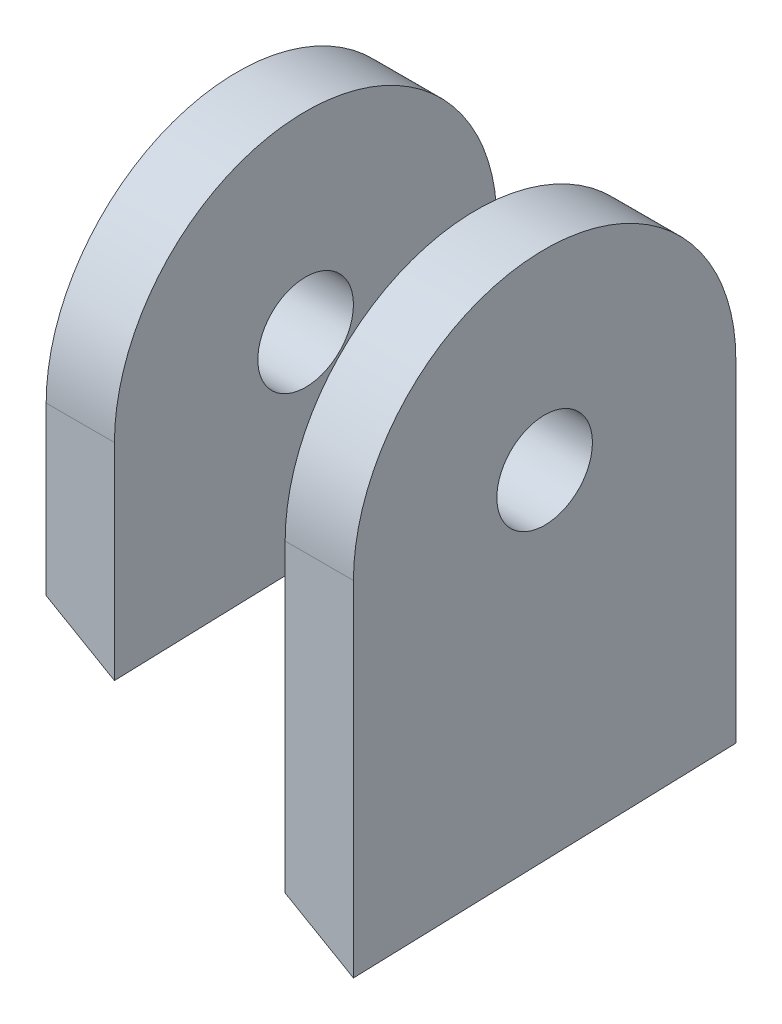
ISO-10303-21;
HEADER;
FILE_DESCRIPTION(('STEP AP214'),'2;1');
FILE_NAME('part.step','',(''),(''),'','','');
FILE_SCHEMA(('AUTOMOTIVE_DESIGN { 1 0 10303 214 1 1 1 1 }'));
ENDSEC;
DATA;
#1=APPLICATION_CONTEXT('core data for automotive mechanical design processes');
#2=APPLICATION_PROTOCOL_DEFINITION('international standard','automotive_design',2000,#1);
#3=PRODUCT_CONTEXT('',#1,'mechanical');
#4=PRODUCT('Part','Part','',(#3));
#5=PRODUCT_RELATED_PRODUCT_CATEGORY('part','',(#4));
#6=PRODUCT_DEFINITION_FORMATION('','',#4);
#7=PRODUCT_DEFINITION_CONTEXT('part definition',#1,'design');
#8=PRODUCT_DEFINITION('design','',#6,#7);
#9=PRODUCT_DEFINITION_SHAPE('','',#8);
#10=(LENGTH_UNIT() NAMED_UNIT(*) SI_UNIT(.MILLI.,.METRE.));
#11=(NAMED_UNIT(*) PLANE_ANGLE_UNIT() SI_UNIT($,.RADIAN.));
#12=(NAMED_UNIT(*) SI_UNIT($,.STERADIAN.) SOLID_ANGLE_UNIT());
#13=UNCERTAINTY_MEASURE_WITH_UNIT(LENGTH_MEASURE(1.E-05),#10,'distance_accuracy_value','');
#14=(GEOMETRIC_REPRESENTATION_CONTEXT(3) GLOBAL_UNCERTAINTY_ASSIGNED_CONTEXT((#13)) GLOBAL_UNIT_ASSIGNED_CONTEXT((#10,
#11,#12)) REPRESENTATION_CONTEXT('',''));
#15=CARTESIAN_POINT('',(0.,0.,0.));
#16=DIRECTION('',(0.,0.,1.));
#17=DIRECTION('',(1.,0.,0.));
#18=AXIS2_PLACEMENT_3D('',#15,#16,#17);
#19=CARTESIAN_POINT('',(-35.,0.,0.));
#20=DIRECTION('',(1.,0.,0.));
#21=DIRECTION('',(0.,0.,-1.));
#22=AXIS2_PLACEMENT_3D('',#19,#20,#21);
#23=CYLINDRICAL_SURFACE('',#22,28.);
#24=DIRECTION('',(1.,0.,0.));
#25=VECTOR('',#24,1.);
#26=CARTESIAN_POINT('',(-35.,0.,28.));
#27=LINE('',#26,#25);
#28=CARTESIAN_POINT('',(-35.,0.,28.));
#29=VERTEX_POINT('',#28);
#30=CARTESIAN_POINT('',(-25.,0.,28.));
#31=VERTEX_POINT('',#30);
#32=EDGE_CURVE('E111',#29,#31,#27,.T.);
#33=ORIENTED_EDGE('',*,*,#32,.T.);
#34=CARTESIAN_POINT('',(-25.,0.,0.));
#35=DIRECTION('',(1.,0.,0.));
#36=DIRECTION('',(0.,0.,-1.));
#37=AXIS2_PLACEMENT_3D('',#34,#35,#36);
#38=CIRCLE('',#37,28.);
#39=CARTESIAN_POINT('',(-25.,0.,-28.));
#40=VERTEX_POINT('',#39);
#41=EDGE_CURVE('E97',#40,#31,#38,.T.);
#42=ORIENTED_EDGE('',*,*,#41,.F.);
#43=DIRECTION('',(1.,0.,0.));
#44=VECTOR('',#43,1.);
#45=CARTESIAN_POINT('',(-35.,0.,-28.));
#46=LINE('',#45,#44);
#47=CARTESIAN_POINT('',(-35.,0.,-28.));
#48=VERTEX_POINT('',#47);
#49=EDGE_CURVE('E107',#48,#40,#46,.T.);
#50=ORIENTED_EDGE('',*,*,#49,.F.);
#51=CARTESIAN_POINT('',(-35.,0.,0.));
#52=DIRECTION('',(1.,0.,0.));
#53=DIRECTION('',(0.,0.,-1.));
#54=AXIS2_PLACEMENT_3D('',#51,#52,#53);
#55=CIRCLE('',#54,28.);
#56=EDGE_CURVE('E110',#48,#29,#55,.T.);
#57=ORIENTED_EDGE('',*,*,#56,.T.);
#58=EDGE_LOOP('',(#33,#42,#50,#57));
#59=FACE_BOUND('',#58,.T.);
#60=ADVANCED_FACE('F45',(#59),#23,.T.);
#61=CARTESIAN_POINT('',(-35.,0.,-28.));
#62=DIRECTION('',(0.,0.,-1.));
#63=DIRECTION('',(0.,1.,0.));
#64=AXIS2_PLACEMENT_3D('',#61,#62,#63);
#65=PLANE('',#64);
#66=DIRECTION('',(0.865916014303439,-0.500189420292799,0.));
#67=VECTOR('',#66,1.);
#68=CARTESIAN_POINT('',(-44.8060613951846,-16.9760199933108,-28.));
#69=LINE('',#68,#67);
#70=CARTESIAN_POINT('',(-35.,-22.6404124789476,-28.));
#71=VERTEX_POINT('',#70);
#72=CARTESIAN_POINT('',(-25.,-28.416832039627,-28.));
#73=VERTEX_POINT('',#72);
#74=EDGE_CURVE('E59',#71,#73,#69,.T.);
#75=ORIENTED_EDGE('',*,*,#74,.F.);
#76=DIRECTION('',(0.,1.,0.));
#77=VECTOR('',#76,1.);
#78=CARTESIAN_POINT('',(-35.,0.,-28.));
#79=LINE('',#78,#77);
#80=EDGE_CURVE('E109',#71,#48,#79,.T.);
#81=ORIENTED_EDGE('',*,*,#80,.T.);
#82=ORIENTED_EDGE('',*,*,#49,.T.);
#83=DIRECTION('',(0.,1.,0.));
#84=VECTOR('',#83,1.);
#85=CARTESIAN_POINT('',(-25.,0.,-28.));
#86=LINE('',#85,#84);
#87=EDGE_CURVE('E53',#73,#40,#86,.T.);
#88=ORIENTED_EDGE('',*,*,#87,.F.);
#89=EDGE_LOOP('',(#75,#81,#82,#88));
#90=FACE_BOUND('',#89,.T.);
#91=ADVANCED_FACE('F140',(#90),#65,.T.);
#92=CARTESIAN_POINT('',(-35.,0.,28.));
#93=DIRECTION('',(0.,0.,1.));
#94=DIRECTION('',(0.,-1.,0.));
#95=AXIS2_PLACEMENT_3D('',#92,#93,#94);
#96=PLANE('',#95);
#97=DIRECTION('',(-0.865916014303439,0.500189420292799,0.));
#98=VECTOR('',#97,1.);
#99=CARTESIAN_POINT('',(-45.5771546501737,-18.3109182756965,28.));
#100=LINE('',#99,#98);
#101=CARTESIAN_POINT('',(-25.,-30.1971461381355,28.));
#102=VERTEX_POINT('',#101);
#103=CARTESIAN_POINT('',(-35.,-24.420726577456,28.));
#104=VERTEX_POINT('',#103);
#105=EDGE_CURVE('E83',#102,#104,#100,.T.);
#106=ORIENTED_EDGE('',*,*,#105,.F.);
#107=DIRECTION('',(0.,-1.,0.));
#108=VECTOR('',#107,1.);
#109=CARTESIAN_POINT('',(-25.,0.,28.));
#110=LINE('',#109,#108);
#111=EDGE_CURVE('E90',#31,#102,#110,.T.);
#112=ORIENTED_EDGE('',*,*,#111,.F.);
#113=ORIENTED_EDGE('',*,*,#32,.F.);
#114=DIRECTION('',(0.,-1.,0.));
#115=VECTOR('',#114,1.);
#116=CARTESIAN_POINT('',(-35.,0.,28.));
#117=LINE('',#116,#115);
#118=EDGE_CURVE('E93',#29,#104,#117,.T.);
#119=ORIENTED_EDGE('',*,*,#118,.T.);
#120=EDGE_LOOP('',(#106,#112,#113,#119));
#121=FACE_BOUND('',#120,.T.);
#122=ADVANCED_FACE('F89',(#121),#96,.T.);
#123=CARTESIAN_POINT('',(-35.,0.,0.));
#124=DIRECTION('',(1.,0.,0.));
#125=DIRECTION('',(0.,0.,-1.));
#126=AXIS2_PLACEMENT_3D('',#123,#124,#125);
#127=CYLINDRICAL_SURFACE('',#126,7.);
#128=CARTESIAN_POINT('',(-35.,0.,0.));
#129=DIRECTION('',(1.,0.,0.));
#130=DIRECTION('',(0.,0.,-1.));
#131=AXIS2_PLACEMENT_3D('',#128,#129,#130);
#132=CIRCLE('',#131,7.);
#133=CARTESIAN_POINT('',(-35.,0.,-7.));
#134=VERTEX_POINT('',#133);
#135=EDGE_CURVE('E100',#134,#134,#132,.T.);
#136=ORIENTED_EDGE('',*,*,#135,.F.);
#137=EDGE_LOOP('',(#136));
#138=FACE_BOUND('',#137,.T.);
#139=CARTESIAN_POINT('',(-25.,0.,0.));
#140=DIRECTION('',(1.,0.,0.));
#141=DIRECTION('',(0.,0.,-1.));
#142=AXIS2_PLACEMENT_3D('',#139,#140,#141);
#143=CIRCLE('',#142,7.);
#144=CARTESIAN_POINT('',(-25.,0.,-7.));
#145=VERTEX_POINT('',#144);
#146=EDGE_CURVE('E104',#145,#145,#143,.T.);
#147=ORIENTED_EDGE('',*,*,#146,.T.);
#148=EDGE_LOOP('',(#147));
#149=FACE_BOUND('',#148,.T.);
#150=ADVANCED_FACE('F47',(#138,#149),#127,.F.);
#151=CARTESIAN_POINT('',(-35.,0.,0.));
#152=DIRECTION('',(1.,0.,0.));
#153=DIRECTION('',(0.,0.,-1.));
#154=AXIS2_PLACEMENT_3D('',#151,#152,#153);
#155=PLANE('',#154);
#156=ORIENTED_EDGE('',*,*,#135,.T.);
#157=EDGE_LOOP('',(#156));
#158=FACE_BOUND('',#157,.T.);
#159=ORIENTED_EDGE('',*,*,#80,.F.);
#160=DIRECTION('',(0.,-0.0317752697972741,0.999495038621658));
#161=VECTOR('',#160,1.);
#162=CARTESIAN_POINT('',(-35.,-23.5068114705232,-0.747312640570566));
#163=LINE('',#162,#161);
#164=EDGE_CURVE('E112',#71,#104,#163,.T.);
#165=ORIENTED_EDGE('',*,*,#164,.T.);
#166=ORIENTED_EDGE('',*,*,#118,.F.);
#167=ORIENTED_EDGE('',*,*,#56,.F.);
#168=EDGE_LOOP('',(#159,#165,#166,#167));
#169=FACE_BOUND('',#168,.T.);
#170=ADVANCED_FACE('F125',(#158,#169),#155,.F.);
#171=CARTESIAN_POINT('',(-25.,0.,0.));
#172=DIRECTION('',(1.,0.,0.));
#173=DIRECTION('',(0.,0.,-1.));
#174=AXIS2_PLACEMENT_3D('',#171,#172,#173);
#175=PLANE('',#174);
#176=DIRECTION('',(0.,-0.0317752697972741,0.999495038621658));
#177=VECTOR('',#176,1.);
#178=CARTESIAN_POINT('',(-25.,-29.2773987665423,-0.930767246280857));
#179=LINE('',#178,#177);
#180=EDGE_CURVE('E12',#73,#102,#179,.T.);
#181=ORIENTED_EDGE('',*,*,#180,.F.);
#182=ORIENTED_EDGE('',*,*,#87,.T.);
#183=ORIENTED_EDGE('',*,*,#41,.T.);
#184=ORIENTED_EDGE('',*,*,#111,.T.);
#185=EDGE_LOOP('',(#181,#182,#183,#184));
#186=FACE_BOUND('',#185,.T.);
#187=ORIENTED_EDGE('',*,*,#146,.F.);
#188=EDGE_LOOP('',(#187));
#189=FACE_BOUND('',#188,.T.);
#190=ADVANCED_FACE('F95',(#186,#189),#175,.T.);
#191=CARTESIAN_POINT('',(-18.9338904190651,-32.7779002549425,-1.04205282041745));
#192=DIRECTION('',(0.499999999999998,0.865588094402866,0.0275181908565438));
#193=DIRECTION('',(-0.865916014303439,0.500189420292799,0.));
#194=AXIS2_PLACEMENT_3D('',#191,#192,#193);
#195=PLANE('',#194);
#196=ORIENTED_EDGE('',*,*,#74,.T.);
#197=ORIENTED_EDGE('',*,*,#180,.T.);
#198=ORIENTED_EDGE('',*,*,#105,.T.);
#199=ORIENTED_EDGE('',*,*,#164,.F.);
#200=EDGE_LOOP('',(#196,#197,#198,#199));
#201=FACE_BOUND('',#200,.T.);
#202=ADVANCED_FACE('F82',(#201),#195,.F.);
#203=CLOSED_SHELL('',(#60,#91,#122,#150,#170,#190,#202));
#204=MANIFOLD_SOLID_BREP('B2',#203);
#205=CARTESIAN_POINT('',(-35.,0.,28.));
#206=DIRECTION('',(0.,0.,1.));
#207=DIRECTION('',(0.,-1.,0.));
#208=AXIS2_PLACEMENT_3D('',#205,#206,#207);
#209=PLANE('',#208);
#210=DIRECTION('',(-0.865916014303439,0.500189420292799,0.));
#211=VECTOR('',#210,1.);
#212=CARTESIAN_POINT('',(-45.5771546501737,-18.3109182756965,28.));
#213=LINE('',#212,#211);
#214=CARTESIAN_POINT('',(10.,-50.4146146005136,28.));
#215=VERTEX_POINT('',#214);
#216=CARTESIAN_POINT('',(0.,-44.6381950398341,28.));
#217=VERTEX_POINT('',#216);
#218=EDGE_CURVE('E205',#215,#217,#213,.T.);
#219=ORIENTED_EDGE('',*,*,#218,.F.);
#220=DIRECTION('',(0.,-1.,0.));
#221=VECTOR('',#220,1.);
#222=CARTESIAN_POINT('',(10.,0.,28.));
#223=LINE('',#222,#221);
#224=CARTESIAN_POINT('',(10.,0.,28.));
#225=VERTEX_POINT('',#224);
#226=EDGE_CURVE('E254',#225,#215,#223,.T.);
#227=ORIENTED_EDGE('',*,*,#226,.F.);
#228=DIRECTION('',(1.,0.,0.));
#229=VECTOR('',#228,1.);
#230=CARTESIAN_POINT('',(-35.,0.,28.));
#231=LINE('',#230,#229);
#232=CARTESIAN_POINT('',(0.,0.,28.));
#233=VERTEX_POINT('',#232);
#234=EDGE_CURVE('E258',#233,#225,#231,.T.);
#235=ORIENTED_EDGE('',*,*,#234,.F.);
#236=DIRECTION('',(0.,-1.,0.));
#237=VECTOR('',#236,1.);
#238=CARTESIAN_POINT('',(0.,0.,28.));
#239=LINE('',#238,#237);
#240=EDGE_CURVE('E245',#233,#217,#239,.T.);
#241=ORIENTED_EDGE('',*,*,#240,.T.);
#242=EDGE_LOOP('',(#219,#227,#235,#241));
#243=FACE_BOUND('',#242,.T.);
#244=ADVANCED_FACE('F190',(#243),#209,.T.);
#245=CARTESIAN_POINT('',(-35.,0.,-28.));
#246=DIRECTION('',(0.,0.,-1.));
#247=DIRECTION('',(0.,1.,0.));
#248=AXIS2_PLACEMENT_3D('',#245,#246,#247);
#249=PLANE('',#248);
#250=DIRECTION('',(0.865916014303439,-0.500189420292799,0.));
#251=VECTOR('',#250,1.);
#252=CARTESIAN_POINT('',(-44.8060613951846,-16.9760199933108,-28.));
#253=LINE('',#252,#251);
#254=CARTESIAN_POINT('',(0.,-42.8578809413257,-28.));
#255=VERTEX_POINT('',#254);
#256=CARTESIAN_POINT('',(10.,-48.6343005020052,-28.));
#257=VERTEX_POINT('',#256);
#258=EDGE_CURVE('E231',#255,#257,#253,.T.);
#259=ORIENTED_EDGE('',*,*,#258,.F.);
#260=DIRECTION('',(0.,1.,0.));
#261=VECTOR('',#260,1.);
#262=CARTESIAN_POINT('',(0.,0.,-28.));
#263=LINE('',#262,#261);
#264=CARTESIAN_POINT('',(0.,0.,-28.));
#265=VERTEX_POINT('',#264);
#266=EDGE_CURVE('E237',#255,#265,#263,.T.);
#267=ORIENTED_EDGE('',*,*,#266,.T.);
#268=DIRECTION('',(1.,0.,0.));
#269=VECTOR('',#268,1.);
#270=CARTESIAN_POINT('',(-35.,0.,-28.));
#271=LINE('',#270,#269);
#272=CARTESIAN_POINT('',(10.,0.,-28.));
#273=VERTEX_POINT('',#272);
#274=EDGE_CURVE('E198',#265,#273,#271,.T.);
#275=ORIENTED_EDGE('',*,*,#274,.T.);
#276=DIRECTION('',(0.,1.,0.));
#277=VECTOR('',#276,1.);
#278=CARTESIAN_POINT('',(10.,0.,-28.));
#279=LINE('',#278,#277);
#280=EDGE_CURVE('E212',#257,#273,#279,.T.);
#281=ORIENTED_EDGE('',*,*,#280,.F.);
#282=EDGE_LOOP('',(#259,#267,#275,#281));
#283=FACE_BOUND('',#282,.T.);
#284=ADVANCED_FACE('F236',(#283),#249,.T.);
#285=CARTESIAN_POINT('',(-35.,0.,0.));
#286=DIRECTION('',(1.,0.,0.));
#287=DIRECTION('',(0.,0.,-1.));
#288=AXIS2_PLACEMENT_3D('',#285,#286,#287);
#289=CYLINDRICAL_SURFACE('',#288,28.);
#290=CARTESIAN_POINT('',(0.,0.,0.));
#291=DIRECTION('',(1.,0.,0.));
#292=DIRECTION('',(0.,0.,-1.));
#293=AXIS2_PLACEMENT_3D('',#290,#291,#292);
#294=CIRCLE('',#293,28.);
#295=EDGE_CURVE('E242',#265,#233,#294,.T.);
#296=ORIENTED_EDGE('',*,*,#295,.T.);
#297=ORIENTED_EDGE('',*,*,#234,.T.);
#298=CARTESIAN_POINT('',(10.,0.,0.));
#299=DIRECTION('',(1.,0.,0.));
#300=DIRECTION('',(0.,0.,-1.));
#301=AXIS2_PLACEMENT_3D('',#298,#299,#300);
#302=CIRCLE('',#301,28.);
#303=EDGE_CURVE('E248',#273,#225,#302,.T.);
#304=ORIENTED_EDGE('',*,*,#303,.F.);
#305=ORIENTED_EDGE('',*,*,#274,.F.);
#306=EDGE_LOOP('',(#296,#297,#304,#305));
#307=FACE_BOUND('',#306,.T.);
#308=ADVANCED_FACE('F192',(#307),#289,.T.);
#309=CARTESIAN_POINT('',(10.,0.,0.));
#310=DIRECTION('',(1.,0.,0.));
#311=DIRECTION('',(0.,0.,-1.));
#312=AXIS2_PLACEMENT_3D('',#309,#310,#311);
#313=PLANE('',#312);
#314=DIRECTION('',(0.,-0.0317752697972741,0.999495038621658));
#315=VECTOR('',#314,1.);
#316=CARTESIAN_POINT('',(10.,-49.474454302609,-1.57285836626688));
#317=LINE('',#316,#315);
#318=EDGE_CURVE('E266',#257,#215,#317,.T.);
#319=ORIENTED_EDGE('',*,*,#318,.F.);
#320=ORIENTED_EDGE('',*,*,#280,.T.);
#321=ORIENTED_EDGE('',*,*,#303,.T.);
#322=ORIENTED_EDGE('',*,*,#226,.T.);
#323=EDGE_LOOP('',(#319,#320,#321,#322));
#324=FACE_BOUND('',#323,.T.);
#325=CARTESIAN_POINT('',(10.,0.,0.));
#326=DIRECTION('',(1.,0.,0.));
#327=DIRECTION('',(0.,0.,-1.));
#328=AXIS2_PLACEMENT_3D('',#325,#326,#327);
#329=CIRCLE('',#328,7.);
#330=CARTESIAN_POINT('',(10.,0.,-7.));
#331=VERTEX_POINT('',#330);
#332=EDGE_CURVE('E244',#331,#331,#329,.T.);
#333=ORIENTED_EDGE('',*,*,#332,.F.);
#334=EDGE_LOOP('',(#333));
#335=FACE_BOUND('',#334,.T.);
#336=ADVANCED_FACE('F264',(#324,#335),#313,.T.);
#337=CARTESIAN_POINT('',(-35.,0.,0.));
#338=DIRECTION('',(1.,0.,0.));
#339=DIRECTION('',(0.,0.,-1.));
#340=AXIS2_PLACEMENT_3D('',#337,#338,#339);
#341=CYLINDRICAL_SURFACE('',#340,7.);
#342=CARTESIAN_POINT('',(0.,0.,0.));
#343=DIRECTION('',(1.,0.,0.));
#344=DIRECTION('',(0.,0.,-1.));
#345=AXIS2_PLACEMENT_3D('',#342,#343,#344);
#346=CIRCLE('',#345,7.);
#347=CARTESIAN_POINT('',(0.,0.,-7.));
#348=VERTEX_POINT('',#347);
#349=EDGE_CURVE('E328',#348,#348,#346,.T.);
#350=ORIENTED_EDGE('',*,*,#349,.F.);
#351=EDGE_LOOP('',(#350));
#352=FACE_BOUND('',#351,.T.);
#353=ORIENTED_EDGE('',*,*,#332,.T.);
#354=EDGE_LOOP('',(#353));
#355=FACE_BOUND('',#354,.T.);
#356=ADVANCED_FACE('F268',(#352,#355),#341,.F.);
#357=CARTESIAN_POINT('',(0.,0.,0.));
#358=DIRECTION('',(1.,0.,0.));
#359=DIRECTION('',(0.,0.,-1.));
#360=AXIS2_PLACEMENT_3D('',#357,#358,#359);
#361=PLANE('',#360);
#362=ORIENTED_EDGE('',*,*,#349,.T.);
#363=EDGE_LOOP('',(#362));
#364=FACE_BOUND('',#363,.T.);
#365=ORIENTED_EDGE('',*,*,#266,.F.);
#366=DIRECTION('',(0.,-0.0317752697972741,0.999495038621658));
#367=VECTOR('',#366,1.);
#368=CARTESIAN_POINT('',(0.,-43.7038670065899,-1.38940376055658));
#369=LINE('',#368,#367);
#370=EDGE_CURVE('E43',#255,#217,#369,.T.);
#371=ORIENTED_EDGE('',*,*,#370,.T.);
#372=ORIENTED_EDGE('',*,*,#240,.F.);
#373=ORIENTED_EDGE('',*,*,#295,.F.);
#374=EDGE_LOOP('',(#365,#371,#372,#373));
#375=FACE_BOUND('',#374,.T.);
#376=ADVANCED_FACE('F240',(#364,#375),#361,.F.);
#377=CARTESIAN_POINT('',(-18.9338904190651,-32.7779002549425,-1.04205282041745));
#378=DIRECTION('',(0.499999999999998,0.865588094402866,0.0275181908565438));
#379=DIRECTION('',(-0.865916014303439,0.500189420292799,0.));
#380=AXIS2_PLACEMENT_3D('',#377,#378,#379);
#381=PLANE('',#380);
#382=ORIENTED_EDGE('',*,*,#318,.T.);
#383=ORIENTED_EDGE('',*,*,#218,.T.);
#384=ORIENTED_EDGE('',*,*,#370,.F.);
#385=ORIENTED_EDGE('',*,*,#258,.T.);
#386=EDGE_LOOP('',(#382,#383,#384,#385));
#387=FACE_BOUND('',#386,.T.);
#388=ADVANCED_FACE('F230',(#387),#381,.F.);
#389=CLOSED_SHELL('',(#244,#284,#308,#336,#356,#376,#388));
#390=MANIFOLD_SOLID_BREP('B6',#389);
#391=ADVANCED_BREP_SHAPE_REPRESENTATION('',(#18,#204,#390),#14);
#392=SHAPE_DEFINITION_REPRESENTATION(#9,#391);
ENDSEC;
END-ISO-10303-21;
